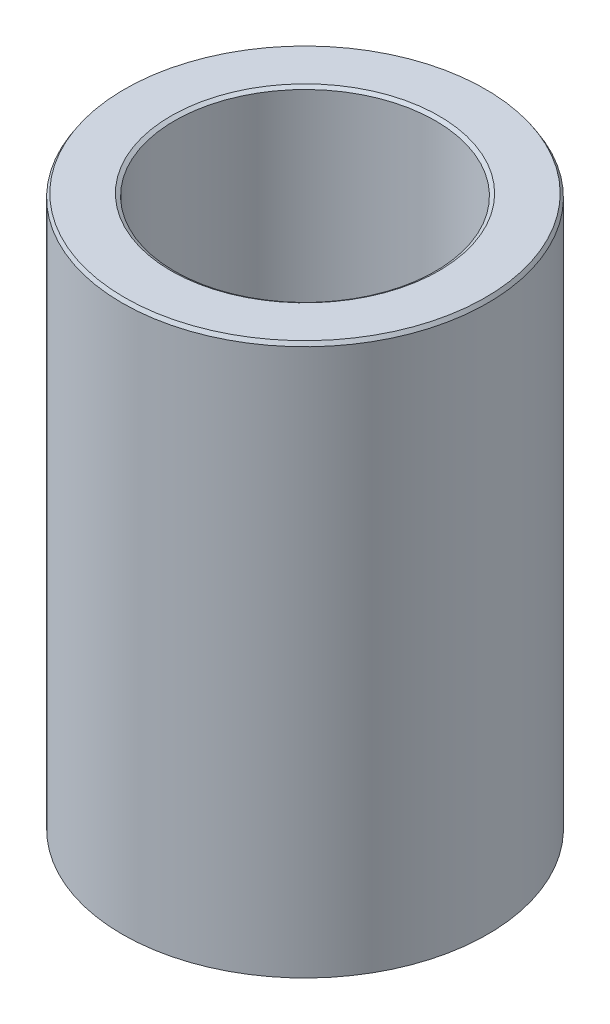
ISO-10303-21;
HEADER;
FILE_DESCRIPTION(('STEP AP214'),'2;1');
FILE_NAME('part.step','',(''),(''),'','','');
FILE_SCHEMA(('AUTOMOTIVE_DESIGN { 1 0 10303 214 1 1 1 1 }'));
ENDSEC;
DATA;
#1=APPLICATION_CONTEXT('core data for automotive mechanical design processes');
#2=APPLICATION_PROTOCOL_DEFINITION('international standard','automotive_design',2000,#1);
#3=PRODUCT_CONTEXT('',#1,'mechanical');
#4=PRODUCT('Part','Part','',(#3));
#5=PRODUCT_RELATED_PRODUCT_CATEGORY('part','',(#4));
#6=PRODUCT_DEFINITION_FORMATION('','',#4);
#7=PRODUCT_DEFINITION_CONTEXT('part definition',#1,'design');
#8=PRODUCT_DEFINITION('design','',#6,#7);
#9=PRODUCT_DEFINITION_SHAPE('','',#8);
#10=(LENGTH_UNIT() NAMED_UNIT(*) SI_UNIT(.MILLI.,.METRE.));
#11=(NAMED_UNIT(*) PLANE_ANGLE_UNIT() SI_UNIT($,.RADIAN.));
#12=(NAMED_UNIT(*) SI_UNIT($,.STERADIAN.) SOLID_ANGLE_UNIT());
#13=UNCERTAINTY_MEASURE_WITH_UNIT(LENGTH_MEASURE(1.E-05),#10,'distance_accuracy_value','');
#14=(GEOMETRIC_REPRESENTATION_CONTEXT(3) GLOBAL_UNCERTAINTY_ASSIGNED_CONTEXT((#13)) GLOBAL_UNIT_ASSIGNED_CONTEXT((#10,
#11,#12)) REPRESENTATION_CONTEXT('',''));
#15=CARTESIAN_POINT('',(0.,0.,0.));
#16=DIRECTION('',(0.,0.,1.));
#17=DIRECTION('',(1.,0.,0.));
#18=AXIS2_PLACEMENT_3D('',#15,#16,#17);
#19=CARTESIAN_POINT('',(0.,105.834409901093,0.));
#20=DIRECTION('',(0.,-1.,0.));
#21=DIRECTION('',(0.,0.,-1.));
#22=AXIS2_PLACEMENT_3D('',#19,#20,#21);
#23=CYLINDRICAL_SURFACE('',#22,35.);
#24=CARTESIAN_POINT('',(0.,0.44001849105979,0.));
#25=DIRECTION('',(0.,1.,0.));
#26=DIRECTION('',(0.,0.,1.));
#27=AXIS2_PLACEMENT_3D('',#24,#25,#26);
#28=CIRCLE('',#27,35.);
#29=CARTESIAN_POINT('',(0.,0.44001849105979,35.));
#30=VERTEX_POINT('',#29);
#31=EDGE_CURVE('E10',#30,#30,#28,.T.);
#32=ORIENTED_EDGE('',*,*,#31,.T.);
#33=EDGE_LOOP('',(#32));
#34=FACE_BOUND('',#33,.T.);
#35=CARTESIAN_POINT('',(0.,105.133345063447,0.));
#36=DIRECTION('',(0.,1.,0.));
#37=DIRECTION('',(0.,0.,1.));
#38=AXIS2_PLACEMENT_3D('',#35,#36,#37);
#39=CIRCLE('',#38,35.);
#40=CARTESIAN_POINT('',(0.,105.133345063447,35.));
#41=VERTEX_POINT('',#40);
#42=EDGE_CURVE('E50',#41,#41,#39,.F.);
#43=ORIENTED_EDGE('',*,*,#42,.T.);
#44=EDGE_LOOP('',(#43));
#45=FACE_BOUND('',#44,.T.);
#46=ADVANCED_FACE('F39',(#34,#45),#23,.T.);
#47=CARTESIAN_POINT('',(0.,105.834409901093,0.));
#48=DIRECTION('',(0.,1.,0.));
#49=DIRECTION('',(0.,0.,1.));
#50=AXIS2_PLACEMENT_3D('',#47,#48,#49);
#51=PLANE('',#50);
#52=CARTESIAN_POINT('',(0.,105.834409901093,0.));
#53=DIRECTION('',(0.,1.,0.));
#54=DIRECTION('',(0.,0.,1.));
#55=AXIS2_PLACEMENT_3D('',#52,#53,#54);
#56=CIRCLE('',#55,25.6808722179567);
#57=CARTESIAN_POINT('',(0.,105.834409901093,25.6808722179567));
#58=VERTEX_POINT('',#57);
#59=EDGE_CURVE('E58',#58,#58,#56,.F.);
#60=ORIENTED_EDGE('',*,*,#59,.T.);
#61=EDGE_LOOP('',(#60));
#62=FACE_BOUND('',#61,.T.);
#63=CARTESIAN_POINT('',(0.,105.834409901093,0.));
#64=DIRECTION('',(0.,1.,0.));
#65=DIRECTION('',(0.,0.,1.));
#66=AXIS2_PLACEMENT_3D('',#63,#64,#65);
#67=CIRCLE('',#66,34.5599815089402);
#68=CARTESIAN_POINT('',(0.,105.834409901093,34.5599815089402));
#69=VERTEX_POINT('',#68);
#70=EDGE_CURVE('E61',#69,#69,#67,.T.);
#71=ORIENTED_EDGE('',*,*,#70,.T.);
#72=EDGE_LOOP('',(#71));
#73=FACE_BOUND('',#72,.T.);
#74=ADVANCED_FACE('F88',(#62,#73),#51,.T.);
#75=CARTESIAN_POINT('',(0.,0.,0.));
#76=DIRECTION('',(0.,1.,0.));
#77=DIRECTION('',(0.,0.,1.));
#78=AXIS2_PLACEMENT_3D('',#75,#76,#77);
#79=PLANE('',#78);
#80=CARTESIAN_POINT('',(0.,0.,0.));
#81=DIRECTION('',(0.,1.,0.));
#82=DIRECTION('',(0.,0.,1.));
#83=AXIS2_PLACEMENT_3D('',#80,#81,#82);
#84=CIRCLE('',#83,25.4198258713708);
#85=CARTESIAN_POINT('',(0.,0.,25.4198258713708));
#86=VERTEX_POINT('',#85);
#87=EDGE_CURVE('E51',#86,#86,#84,.T.);
#88=ORIENTED_EDGE('',*,*,#87,.T.);
#89=EDGE_LOOP('',(#88));
#90=FACE_BOUND('',#89,.T.);
#91=CARTESIAN_POINT('',(0.,0.,0.));
#92=DIRECTION('',(0.,1.,0.));
#93=DIRECTION('',(0.,0.,1.));
#94=AXIS2_PLACEMENT_3D('',#91,#92,#93);
#95=CIRCLE('',#94,34.2989351623543);
#96=CARTESIAN_POINT('',(0.,0.,34.2989351623543));
#97=VERTEX_POINT('',#96);
#98=EDGE_CURVE('E54',#97,#97,#95,.F.);
#99=ORIENTED_EDGE('',*,*,#98,.T.);
#100=EDGE_LOOP('',(#99));
#101=FACE_BOUND('',#100,.T.);
#102=ADVANCED_FACE('F83',(#90,#101),#79,.F.);
#103=CARTESIAN_POINT('',(0.,105.834409901093,0.));
#104=DIRECTION('',(0.,-1.,0.));
#105=DIRECTION('',(0.,0.,-1.));
#106=AXIS2_PLACEMENT_3D('',#103,#104,#105);
#107=CYLINDRICAL_SURFACE('',#106,24.979807380311);
#108=CARTESIAN_POINT('',(0.,105.394391410033,0.));
#109=DIRECTION('',(0.,1.,0.));
#110=DIRECTION('',(0.,0.,1.));
#111=AXIS2_PLACEMENT_3D('',#108,#109,#110);
#112=CIRCLE('',#111,24.979807380311);
#113=CARTESIAN_POINT('',(0.,105.394391410033,24.979807380311));
#114=VERTEX_POINT('',#113);
#115=EDGE_CURVE('E67',#114,#114,#112,.T.);
#116=ORIENTED_EDGE('',*,*,#115,.T.);
#117=EDGE_LOOP('',(#116));
#118=FACE_BOUND('',#117,.T.);
#119=CARTESIAN_POINT('',(0.,0.701064837645773,0.));
#120=DIRECTION('',(0.,1.,0.));
#121=DIRECTION('',(0.,0.,1.));
#122=AXIS2_PLACEMENT_3D('',#119,#120,#121);
#123=CIRCLE('',#122,24.979807380311);
#124=CARTESIAN_POINT('',(0.,0.701064837645773,24.979807380311));
#125=VERTEX_POINT('',#124);
#126=EDGE_CURVE('E69',#125,#125,#123,.F.);
#127=ORIENTED_EDGE('',*,*,#126,.T.);
#128=EDGE_LOOP('',(#127));
#129=FACE_BOUND('',#128,.T.);
#130=ADVANCED_FACE('F71',(#118,#129),#107,.F.);
#131=CARTESIAN_POINT('',(0.,105.394391410033,0.));
#132=DIRECTION('',(0.,1.,0.));
#133=DIRECTION('',(0.,0.,1.));
#134=AXIS2_PLACEMENT_3D('',#131,#132,#133);
#135=CONICAL_SURFACE('',#134,24.979807380311,1.01029863001768);
#136=ORIENTED_EDGE('',*,*,#59,.F.);
#137=EDGE_LOOP('',(#136));
#138=FACE_BOUND('',#137,.T.);
#139=ORIENTED_EDGE('',*,*,#115,.F.);
#140=EDGE_LOOP('',(#139));
#141=FACE_BOUND('',#140,.T.);
#142=ADVANCED_FACE('F77',(#138,#141),#135,.F.);
#143=CARTESIAN_POINT('',(0.,0.,0.));
#144=DIRECTION('',(0.,-1.,0.));
#145=DIRECTION('',(0.,0.,-1.));
#146=AXIS2_PLACEMENT_3D('',#143,#144,#145);
#147=CONICAL_SURFACE('',#146,25.4198258713708,0.560497696777211);
#148=ORIENTED_EDGE('',*,*,#126,.F.);
#149=EDGE_LOOP('',(#148));
#150=FACE_BOUND('',#149,.T.);
#151=ORIENTED_EDGE('',*,*,#87,.F.);
#152=EDGE_LOOP('',(#151));
#153=FACE_BOUND('',#152,.T.);
#154=ADVANCED_FACE('F73',(#150,#153),#147,.F.);
#155=CARTESIAN_POINT('',(0.,0.44001849105979,0.));
#156=DIRECTION('',(0.,1.,0.));
#157=DIRECTION('',(0.,0.,1.));
#158=AXIS2_PLACEMENT_3D('',#155,#156,#157);
#159=CONICAL_SURFACE('',#158,35.,1.01029863001767);
#160=ORIENTED_EDGE('',*,*,#98,.F.);
#161=EDGE_LOOP('',(#160));
#162=FACE_BOUND('',#161,.T.);
#163=ORIENTED_EDGE('',*,*,#31,.F.);
#164=EDGE_LOOP('',(#163));
#165=FACE_BOUND('',#164,.T.);
#166=ADVANCED_FACE('F76',(#162,#165),#159,.T.);
#167=CARTESIAN_POINT('',(0.,105.834409901093,0.));
#168=DIRECTION('',(0.,-1.,0.));
#169=DIRECTION('',(0.,0.,-1.));
#170=AXIS2_PLACEMENT_3D('',#167,#168,#169);
#171=CONICAL_SURFACE('',#170,34.5599815089402,0.560497696777211);
#172=ORIENTED_EDGE('',*,*,#42,.F.);
#173=EDGE_LOOP('',(#172));
#174=FACE_BOUND('',#173,.T.);
#175=ORIENTED_EDGE('',*,*,#70,.F.);
#176=EDGE_LOOP('',(#175));
#177=FACE_BOUND('',#176,.T.);
#178=ADVANCED_FACE('F45',(#174,#177),#171,.T.);
#179=CLOSED_SHELL('',(#46,#74,#102,#130,#142,#154,#166,#178));
#180=MANIFOLD_SOLID_BREP('B2',#179);
#181=ADVANCED_BREP_SHAPE_REPRESENTATION('',(#18,#180),#14);
#182=SHAPE_DEFINITION_REPRESENTATION(#9,#181);
ENDSEC;
END-ISO-10303-21;
